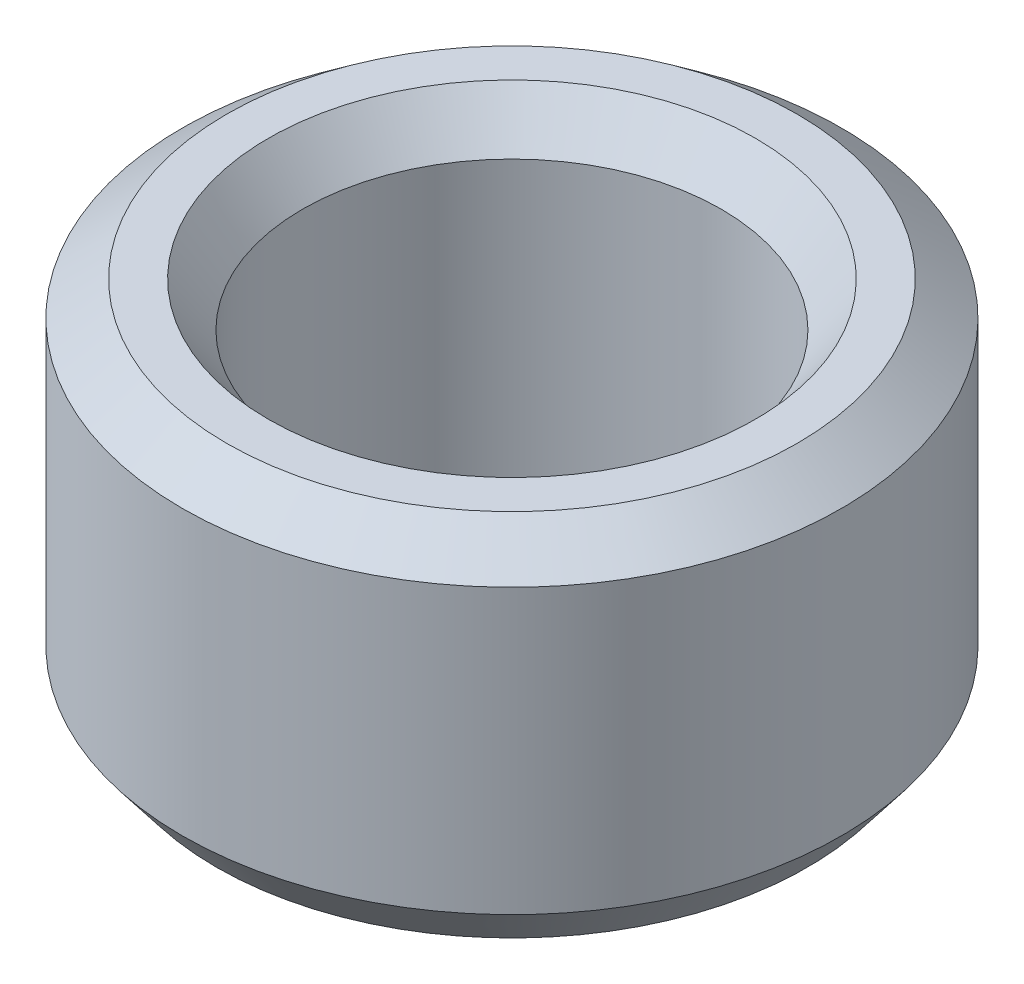
ISO-10303-21;
HEADER;
FILE_DESCRIPTION(('STEP AP214'),'2;1');
FILE_NAME('part.step','',(''),(''),'','','');
FILE_SCHEMA(('AUTOMOTIVE_DESIGN { 1 0 10303 214 1 1 1 1 }'));
ENDSEC;
DATA;
#1=APPLICATION_CONTEXT('core data for automotive mechanical design processes');
#2=APPLICATION_PROTOCOL_DEFINITION('international standard','automotive_design',2000,#1);
#3=PRODUCT_CONTEXT('',#1,'mechanical');
#4=PRODUCT('Part','Part','',(#3));
#5=PRODUCT_RELATED_PRODUCT_CATEGORY('part','',(#4));
#6=PRODUCT_DEFINITION_FORMATION('','',#4);
#7=PRODUCT_DEFINITION_CONTEXT('part definition',#1,'design');
#8=PRODUCT_DEFINITION('design','',#6,#7);
#9=PRODUCT_DEFINITION_SHAPE('','',#8);
#10=(LENGTH_UNIT() NAMED_UNIT(*) SI_UNIT(.MILLI.,.METRE.));
#11=(NAMED_UNIT(*) PLANE_ANGLE_UNIT() SI_UNIT($,.RADIAN.));
#12=(NAMED_UNIT(*) SI_UNIT($,.STERADIAN.) SOLID_ANGLE_UNIT());
#13=UNCERTAINTY_MEASURE_WITH_UNIT(LENGTH_MEASURE(1.E-05),#10,'distance_accuracy_value','');
#14=(GEOMETRIC_REPRESENTATION_CONTEXT(3) GLOBAL_UNCERTAINTY_ASSIGNED_CONTEXT((#13)) GLOBAL_UNIT_ASSIGNED_CONTEXT((#10,
#11,#12)) REPRESENTATION_CONTEXT('',''));
#15=CARTESIAN_POINT('',(0.,0.,0.));
#16=DIRECTION('',(0.,0.,1.));
#17=DIRECTION('',(1.,0.,0.));
#18=AXIS2_PLACEMENT_3D('',#15,#16,#17);
#19=CARTESIAN_POINT('',(0.,41.193797116807,0.));
#20=DIRECTION('',(0.,-1.,0.));
#21=DIRECTION('',(0.,0.,-1.));
#22=AXIS2_PLACEMENT_3D('',#19,#20,#21);
#23=CYLINDRICAL_SURFACE('',#22,37.5);
#24=CARTESIAN_POINT('',(0.,5.04609549985052,0.));
#25=DIRECTION('',(0.,1.,0.));
#26=DIRECTION('',(0.,0.,1.));
#27=AXIS2_PLACEMENT_3D('',#24,#25,#26);
#28=CIRCLE('',#27,37.5);
#29=CARTESIAN_POINT('',(0.,5.04609549985052,37.5));
#30=VERTEX_POINT('',#29);
#31=EDGE_CURVE('E10',#30,#30,#28,.T.);
#32=ORIENTED_EDGE('',*,*,#31,.T.);
#33=EDGE_LOOP('',(#32));
#34=FACE_BOUND('',#33,.T.);
#35=CARTESIAN_POINT('',(0.,37.3075683079298,0.));
#36=DIRECTION('',(0.,1.,0.));
#37=DIRECTION('',(0.,0.,1.));
#38=AXIS2_PLACEMENT_3D('',#35,#36,#37);
#39=CIRCLE('',#38,37.5);
#40=CARTESIAN_POINT('',(0.,37.3075683079298,37.5));
#41=VERTEX_POINT('',#40);
#42=EDGE_CURVE('E50',#41,#41,#39,.F.);
#43=ORIENTED_EDGE('',*,*,#42,.T.);
#44=EDGE_LOOP('',(#43));
#45=FACE_BOUND('',#44,.T.);
#46=ADVANCED_FACE('F39',(#34,#45),#23,.T.);
#47=CARTESIAN_POINT('',(0.,41.193797116807,0.));
#48=DIRECTION('',(0.,1.,0.));
#49=DIRECTION('',(0.,0.,1.));
#50=AXIS2_PLACEMENT_3D('',#47,#48,#49);
#51=PLANE('',#50);
#52=CARTESIAN_POINT('',(0.,41.193797116807,0.));
#53=DIRECTION('',(0.,1.,0.));
#54=DIRECTION('',(0.,0.,1.));
#55=AXIS2_PLACEMENT_3D('',#52,#53,#54);
#56=CIRCLE('',#55,27.7051902657105);
#57=CARTESIAN_POINT('',(0.,41.193797116807,27.7051902657105));
#58=VERTEX_POINT('',#57);
#59=EDGE_CURVE('E58',#58,#58,#56,.F.);
#60=ORIENTED_EDGE('',*,*,#59,.T.);
#61=EDGE_LOOP('',(#60));
#62=FACE_BOUND('',#61,.T.);
#63=CARTESIAN_POINT('',(0.,41.193797116807,0.));
#64=DIRECTION('',(0.,1.,0.));
#65=DIRECTION('',(0.,0.,1.));
#66=AXIS2_PLACEMENT_3D('',#63,#64,#65);
#67=CIRCLE('',#66,32.4539045001495);
#68=CARTESIAN_POINT('',(0.,41.193797116807,32.4539045001495));
#69=VERTEX_POINT('',#68);
#70=EDGE_CURVE('E61',#69,#69,#67,.T.);
#71=ORIENTED_EDGE('',*,*,#70,.T.);
#72=EDGE_LOOP('',(#71));
#73=FACE_BOUND('',#72,.T.);
#74=ADVANCED_FACE('F88',(#62,#73),#51,.T.);
#75=CARTESIAN_POINT('',(0.,0.,0.));
#76=DIRECTION('',(0.,1.,0.));
#77=DIRECTION('',(0.,0.,1.));
#78=AXIS2_PLACEMENT_3D('',#75,#76,#77);
#79=PLANE('',#78);
#80=CARTESIAN_POINT('',(0.,0.,0.));
#81=DIRECTION('',(0.,1.,0.));
#82=DIRECTION('',(0.,0.,1.));
#83=AXIS2_PLACEMENT_3D('',#80,#81,#82);
#84=CIRCLE('',#83,28.8650569566839);
#85=CARTESIAN_POINT('',(0.,0.,-28.8650569566839));
#86=VERTEX_POINT('',#85);
#87=EDGE_CURVE('E51',#86,#86,#84,.T.);
#88=ORIENTED_EDGE('',*,*,#87,.T.);
#89=EDGE_LOOP('',(#88));
#90=FACE_BOUND('',#89,.T.);
#91=CARTESIAN_POINT('',(0.,0.,0.));
#92=DIRECTION('',(0.,1.,0.));
#93=DIRECTION('',(0.,0.,1.));
#94=AXIS2_PLACEMENT_3D('',#91,#92,#93);
#95=CIRCLE('',#94,33.6137711911228);
#96=CARTESIAN_POINT('',(0.,0.,33.6137711911228));
#97=VERTEX_POINT('',#96);
#98=EDGE_CURVE('E54',#97,#97,#95,.F.);
#99=ORIENTED_EDGE('',*,*,#98,.T.);
#100=EDGE_LOOP('',(#99));
#101=FACE_BOUND('',#100,.T.);
#102=ADVANCED_FACE('F83',(#90,#101),#79,.F.);
#103=CARTESIAN_POINT('',(0.,41.193797116807,0.));
#104=DIRECTION('',(0.,-1.,0.));
#105=DIRECTION('',(0.,0.,-1.));
#106=AXIS2_PLACEMENT_3D('',#103,#104,#105);
#107=CYLINDRICAL_SURFACE('',#106,23.8189614568334);
#108=CARTESIAN_POINT('',(0.,36.1477016169565,0.));
#109=DIRECTION('',(0.,1.,0.));
#110=DIRECTION('',(0.,0.,1.));
#111=AXIS2_PLACEMENT_3D('',#108,#109,#110);
#112=CIRCLE('',#111,23.8189614568334);
#113=CARTESIAN_POINT('',(0.,36.1477016169565,23.8189614568334));
#114=VERTEX_POINT('',#113);
#115=EDGE_CURVE('E67',#114,#114,#112,.T.);
#116=ORIENTED_EDGE('',*,*,#115,.T.);
#117=EDGE_LOOP('',(#116));
#118=FACE_BOUND('',#117,.T.);
#119=CARTESIAN_POINT('',(0.,3.88622880887718,0.));
#120=DIRECTION('',(0.,1.,0.));
#121=DIRECTION('',(0.,0.,1.));
#122=AXIS2_PLACEMENT_3D('',#119,#120,#121);
#123=CIRCLE('',#122,23.8189614568334);
#124=CARTESIAN_POINT('',(0.,3.88622880887718,-23.8189614568334));
#125=VERTEX_POINT('',#124);
#126=EDGE_CURVE('E69',#125,#125,#123,.F.);
#127=ORIENTED_EDGE('',*,*,#126,.T.);
#128=EDGE_LOOP('',(#127));
#129=FACE_BOUND('',#128,.T.);
#130=ADVANCED_FACE('F71',(#118,#129),#107,.F.);
#131=CARTESIAN_POINT('',(0.,36.1477016169565,0.));
#132=DIRECTION('',(0.,1.,0.));
#133=DIRECTION('',(0.,0.,1.));
#134=AXIS2_PLACEMENT_3D('',#131,#132,#133);
#135=CONICAL_SURFACE('',#134,23.8189614568334,0.656270187139994);
#136=ORIENTED_EDGE('',*,*,#59,.F.);
#137=EDGE_LOOP('',(#136));
#138=FACE_BOUND('',#137,.T.);
#139=ORIENTED_EDGE('',*,*,#115,.F.);
#140=EDGE_LOOP('',(#139));
#141=FACE_BOUND('',#140,.T.);
#142=ADVANCED_FACE('F77',(#138,#141),#135,.F.);
#143=CARTESIAN_POINT('',(0.,0.,0.));
#144=DIRECTION('',(0.,-1.,0.));
#145=DIRECTION('',(0.,0.,-1.));
#146=AXIS2_PLACEMENT_3D('',#143,#144,#145);
#147=CONICAL_SURFACE('',#146,28.8650569566839,0.914526139654902);
#148=CARTESIAN_POINT('',(0.,3.88622880887718,-23.8189614568334));
#149=CARTESIAN_POINT('',(0.,3.84574725878471,-23.8715249516235));
#150=CARTESIAN_POINT('',(0.,3.80526570869224,-23.9240884464136));
#151=CARTESIAN_POINT('',(0.,3.7243026085073,-24.0292154359938));
#152=CARTESIAN_POINT('',(0.,3.68382105841483,-24.081778930784));
#153=CARTESIAN_POINT('',(0.,3.60285795822988,-24.1869059203642));
#154=CARTESIAN_POINT('',(0.,3.56237640813741,-24.2394694151543));
#155=CARTESIAN_POINT('',(0.,3.48141330795247,-24.3445964047345));
#156=CARTESIAN_POINT('',(0.,3.44093175786,-24.3971598995246));
#157=CARTESIAN_POINT('',(0.,3.35996865767506,-24.5022868891048));
#158=CARTESIAN_POINT('',(0.,3.31948710758259,-24.5548503838949));
#159=CARTESIAN_POINT('',(0.,3.23852400739765,-24.6599773734752));
#160=CARTESIAN_POINT('',(0.,3.19804245730518,-24.7125408682653));
#161=CARTESIAN_POINT('',(0.,3.11707935712024,-24.8176678578455));
#162=CARTESIAN_POINT('',(0.,3.07659780702777,-24.8702313526356));
#163=CARTESIAN_POINT('',(0.,2.99563470684282,-24.9753583422158));
#164=CARTESIAN_POINT('',(0.,2.95515315675035,-25.0279218370059));
#165=CARTESIAN_POINT('',(0.,2.87419005656541,-25.1330488265861));
#166=CARTESIAN_POINT('',(0.,2.83370850647294,-25.1856123213763));
#167=CARTESIAN_POINT('',(0.,2.752745406288,-25.2907393109565));
#168=CARTESIAN_POINT('',(0.,2.71226385619553,-25.3433028057466));
#169=CARTESIAN_POINT('',(0.,2.63130075601059,-25.4484297953268));
#170=CARTESIAN_POINT('',(0.,2.59081920591812,-25.5009932901169));
#171=CARTESIAN_POINT('',(0.,2.50985610573318,-25.6061202796971));
#172=CARTESIAN_POINT('',(0.,2.46937455564071,-25.6586837744872));
#173=CARTESIAN_POINT('',(0.,2.38841145545577,-25.7638107640675));
#174=CARTESIAN_POINT('',(0.,2.3479299053633,-25.8163742588576));
#175=CARTESIAN_POINT('',(0.,2.26696680517835,-25.9215012484378));
#176=CARTESIAN_POINT('',(0.,2.22648525508588,-25.9740647432279));
#177=CARTESIAN_POINT('',(0.,2.14552215490094,-26.0791917328081));
#178=CARTESIAN_POINT('',(0.,2.10504060480847,-26.1317552275982));
#179=CARTESIAN_POINT('',(0.,2.02407750462353,-26.2368822171784));
#180=CARTESIAN_POINT('',(0.,1.98359595453106,-26.2894457119685));
#181=CARTESIAN_POINT('',(0.,1.90263285434612,-26.3945727015488));
#182=CARTESIAN_POINT('',(0.,1.86215130425365,-26.4471361963389));
#183=CARTESIAN_POINT('',(0.,1.78118820406871,-26.5522631859191));
#184=CARTESIAN_POINT('',(0.,1.74070665397624,-26.6048266807092));
#185=CARTESIAN_POINT('',(0.,1.6597435537913,-26.7099536702894));
#186=CARTESIAN_POINT('',(0.,1.61926200369882,-26.7625171650795));
#187=CARTESIAN_POINT('',(0.,1.53829890351388,-26.8676441546598));
#188=CARTESIAN_POINT('',(0.,1.49781735342141,-26.9202076494499));
#189=CARTESIAN_POINT('',(0.,1.41685425323647,-27.0253346390301));
#190=CARTESIAN_POINT('',(0.,1.376372703144,-27.0778981338202));
#191=CARTESIAN_POINT('',(0.,1.29540960295906,-27.1830251234004));
#192=CARTESIAN_POINT('',(0.,1.25492805286659,-27.2355886181905));
#193=CARTESIAN_POINT('',(0.,1.17396495268165,-27.3407156077707));
#194=CARTESIAN_POINT('',(0.,1.13348340258918,-27.3932791025608));
#195=CARTESIAN_POINT('',(0.,1.05252030240424,-27.4984060921411));
#196=CARTESIAN_POINT('',(0.,1.01203875231176,-27.5509695869312));
#197=CARTESIAN_POINT('',(0.,0.931075652126824,-27.6560965765114));
#198=CARTESIAN_POINT('',(0.,0.890594102034354,-27.7086600713015));
#199=CARTESIAN_POINT('',(0.,0.809631001849413,-27.8137870608817));
#200=CARTESIAN_POINT('',(0.,0.769149451756942,-27.8663505556718));
#201=CARTESIAN_POINT('',(0.,0.688186351572,-27.9714775452521));
#202=CARTESIAN_POINT('',(0.,0.647704801479529,-28.0240410400422));
#203=CARTESIAN_POINT('',(0.,0.566741701294588,-28.1291680296224));
#204=CARTESIAN_POINT('',(0.,0.526260151202118,-28.1817315244125));
#205=CARTESIAN_POINT('',(0.,0.445297051017177,-28.2868585139927));
#206=CARTESIAN_POINT('',(0.,0.404815500924706,-28.3394220087828));
#207=CARTESIAN_POINT('',(0.,0.323852400739765,-28.444548998363));
#208=CARTESIAN_POINT('',(0.,0.283370850647294,-28.4971124931531));
#209=CARTESIAN_POINT('',(0.,0.202407750462353,-28.6022394827334));
#210=CARTESIAN_POINT('',(0.,0.161926200369882,-28.6548029775235));
#211=CARTESIAN_POINT('',(0.,0.0809631001849418,-28.7599299671037));
#212=CARTESIAN_POINT('',(0.,0.0404815500924714,-28.8124934618938));
#213=CARTESIAN_POINT('',(0.,0.,-28.8650569566839));
#214=B_SPLINE_CURVE_WITH_KNOTS('',3,(#148,#149,#150,#151,#152,#153,#154,#155,#156,#157,#158,
#159,#160,#161,#162,#163,#164,#165,#166,#167,#168,#169,#170,#171,#172,#173,#174,#175,#176,#177,
#178,#179,#180,#181,#182,#183,#184,#185,#186,#187,#188,#189,#190,#191,#192,#193,#194,#195,#196,
#197,#198,#199,#200,#201,#202,#203,#204,#205,#206,#207,#208,#209,#210,#211,#212,#213),
.UNSPECIFIED.,.F.,.F.,(4,2,2,2,2,2,2,2,2,2,2,2,2,2,2,2,2,2,2,2,2,2,2,2,2,2,2,2,2,2,2,2,4),(0.,
0.199035403740016,0.398070807480035,0.597106211220051,0.796141614960067,0.995177018700086,
1.1942124224401,1.39324782618012,1.59228322992014,1.79131863366015,1.99035403740017,
2.18938944114019,2.38842484488021,2.58746024862022,2.78649565236024,2.98553105610026,
3.18456645984027,3.38360186358029,3.58263726732031,3.78167267106032,3.98070807480034,
4.17974347854036,4.37877888228038,4.57781428602039,4.77684968976041,4.97588509350043,
5.17492049724045,5.37395590098046,5.57299130472048,5.7720267084605,5.97106211220051,
6.17009751594053,6.36913291968055),.UNSPECIFIED.);
#215=EDGE_CURVE('BSEAM73',#125,#86,#214,.T.);
#216=ORIENTED_EDGE('',*,*,#126,.F.);
#217=ORIENTED_EDGE('',*,*,#87,.F.);
#218=ORIENTED_EDGE('',*,*,#215,.T.);
#219=ORIENTED_EDGE('',*,*,#215,.F.);
#220=EDGE_LOOP('',(#216,#218,#217,#219));
#221=FACE_BOUND('',#220,.T.);
#222=ADVANCED_FACE('F73',(#221),#147,.F.);
#223=CARTESIAN_POINT('',(0.,5.04609549985052,0.));
#224=DIRECTION('',(0.,1.,0.));
#225=DIRECTION('',(0.,0.,1.));
#226=AXIS2_PLACEMENT_3D('',#223,#224,#225);
#227=CONICAL_SURFACE('',#226,37.5,0.656270187139994);
#228=ORIENTED_EDGE('',*,*,#98,.F.);
#229=EDGE_LOOP('',(#228));
#230=FACE_BOUND('',#229,.T.);
#231=ORIENTED_EDGE('',*,*,#31,.F.);
#232=EDGE_LOOP('',(#231));
#233=FACE_BOUND('',#232,.T.);
#234=ADVANCED_FACE('F76',(#230,#233),#227,.T.);
#235=CARTESIAN_POINT('',(0.,41.193797116807,0.));
#236=DIRECTION('',(0.,-1.,0.));
#237=DIRECTION('',(0.,0.,-1.));
#238=AXIS2_PLACEMENT_3D('',#235,#236,#237);
#239=CONICAL_SURFACE('',#238,32.4539045001495,0.914526139654901);
#240=ORIENTED_EDGE('',*,*,#42,.F.);
#241=EDGE_LOOP('',(#240));
#242=FACE_BOUND('',#241,.T.);
#243=ORIENTED_EDGE('',*,*,#70,.F.);
#244=EDGE_LOOP('',(#243));
#245=FACE_BOUND('',#244,.T.);
#246=ADVANCED_FACE('F45',(#242,#245),#239,.T.);
#247=CLOSED_SHELL('',(#46,#74,#102,#130,#142,#222,#234,#246));
#248=MANIFOLD_SOLID_BREP('B2',#247);
#249=ADVANCED_BREP_SHAPE_REPRESENTATION('',(#18,#248),#14);
#250=SHAPE_DEFINITION_REPRESENTATION(#9,#249);
ENDSEC;
END-ISO-10303-21;
